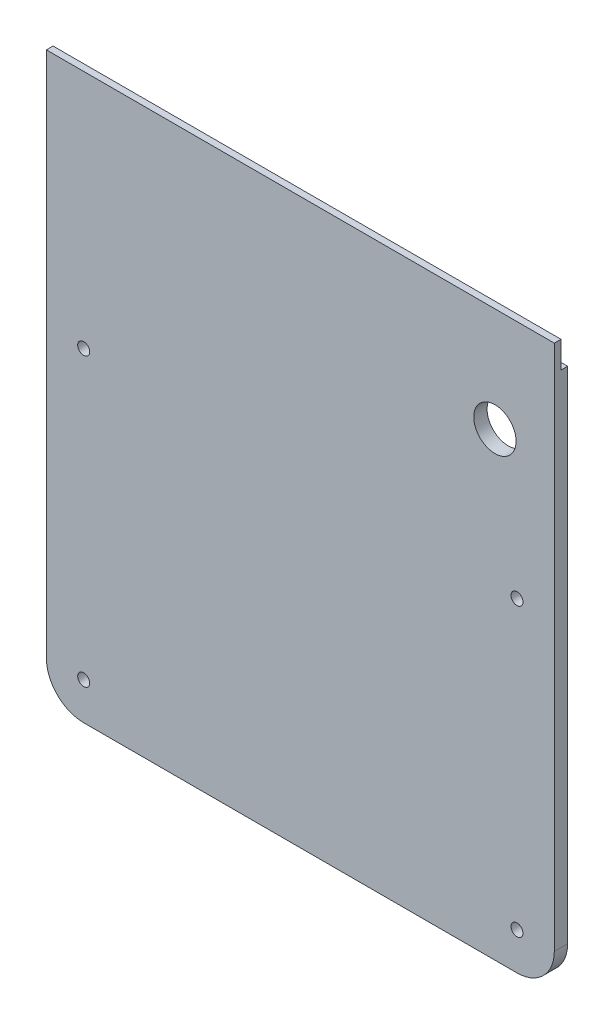
ISO-10303-21;
HEADER;
FILE_DESCRIPTION(('STEP AP214'),'2;1');
FILE_NAME('part.step','',(''),(''),'','','');
FILE_SCHEMA(('AUTOMOTIVE_DESIGN { 1 0 10303 214 1 1 1 1 }'));
ENDSEC;
DATA;
#1=APPLICATION_CONTEXT('core data for automotive mechanical design processes');
#2=APPLICATION_PROTOCOL_DEFINITION('international standard','automotive_design',2000,#1);
#3=PRODUCT_CONTEXT('',#1,'mechanical');
#4=PRODUCT('Part','Part','',(#3));
#5=PRODUCT_RELATED_PRODUCT_CATEGORY('part','',(#4));
#6=PRODUCT_DEFINITION_FORMATION('','',#4);
#7=PRODUCT_DEFINITION_CONTEXT('part definition',#1,'design');
#8=PRODUCT_DEFINITION('design','',#6,#7);
#9=PRODUCT_DEFINITION_SHAPE('','',#8);
#10=(LENGTH_UNIT() NAMED_UNIT(*) SI_UNIT(.MILLI.,.METRE.));
#11=(NAMED_UNIT(*) PLANE_ANGLE_UNIT() SI_UNIT($,.RADIAN.));
#12=(NAMED_UNIT(*) SI_UNIT($,.STERADIAN.) SOLID_ANGLE_UNIT());
#13=UNCERTAINTY_MEASURE_WITH_UNIT(LENGTH_MEASURE(1.E-05),#10,'distance_accuracy_value','');
#14=(GEOMETRIC_REPRESENTATION_CONTEXT(3) GLOBAL_UNCERTAINTY_ASSIGNED_CONTEXT((#13)) GLOBAL_UNIT_ASSIGNED_CONTEXT((#10,
#11,#12)) REPRESENTATION_CONTEXT('',''));
#15=CARTESIAN_POINT('',(0.,0.,0.));
#16=DIRECTION('',(0.,0.,1.));
#17=DIRECTION('',(1.,0.,0.));
#18=AXIS2_PLACEMENT_3D('',#15,#16,#17);
#19=CARTESIAN_POINT('',(-80.0801129234629,0.,5.));
#20=DIRECTION('',(-1.,0.,0.));
#21=DIRECTION('',(0.,-1.,0.));
#22=AXIS2_PLACEMENT_3D('',#19,#20,#21);
#23=PLANE('',#22);
#24=DIRECTION('',(0.,0.,-1.));
#25=VECTOR('',#24,1.);
#26=CARTESIAN_POINT('',(-80.080112923463,-1000.00000000001,2.5));
#27=LINE('',#26,#25);
#28=CARTESIAN_POINT('',(-80.080112923463,-1000.00000000001,2.5));
#29=VERTEX_POINT('',#28);
#30=CARTESIAN_POINT('',(-80.080112923463,-1000.00000000001,0.));
#31=VERTEX_POINT('',#30);
#32=EDGE_CURVE('E132',#29,#31,#27,.T.);
#33=ORIENTED_EDGE('',*,*,#32,.T.);
#34=DIRECTION('',(0.,1.,0.));
#35=VECTOR('',#34,1.);
#36=CARTESIAN_POINT('',(-80.0801129234629,0.,0.));
#37=LINE('',#36,#35);
#38=CARTESIAN_POINT('',(-80.0801129234629,-1187.56262000001,0.));
#39=VERTEX_POINT('',#38);
#40=EDGE_CURVE('E165',#39,#31,#37,.T.);
#41=ORIENTED_EDGE('',*,*,#40,.F.);
#42=DIRECTION('',(0.,0.,-1.));
#43=VECTOR('',#42,1.);
#44=CARTESIAN_POINT('',(-80.0801129234629,-1187.56262000001,5.));
#45=LINE('',#44,#43);
#46=CARTESIAN_POINT('',(-80.0801129234629,-1187.56262000001,5.));
#47=VERTEX_POINT('',#46);
#48=EDGE_CURVE('E11',#47,#39,#45,.T.);
#49=ORIENTED_EDGE('',*,*,#48,.F.);
#50=DIRECTION('',(0.,1.,0.));
#51=VECTOR('',#50,1.);
#52=CARTESIAN_POINT('',(-80.0801129234629,0.,5.));
#53=LINE('',#52,#51);
#54=CARTESIAN_POINT('',(-80.080112923463,-990.000000000007,5.));
#55=VERTEX_POINT('',#54);
#56=EDGE_CURVE('E131',#47,#55,#53,.T.);
#57=ORIENTED_EDGE('',*,*,#56,.T.);
#58=DIRECTION('',(0.,0.,-1.));
#59=VECTOR('',#58,1.);
#60=CARTESIAN_POINT('',(-80.080112923463,-990.000000000007,5.));
#61=LINE('',#60,#59);
#62=CARTESIAN_POINT('',(-80.080112923463,-990.000000000007,2.5));
#63=VERTEX_POINT('',#62);
#64=EDGE_CURVE('E117',#55,#63,#61,.T.);
#65=ORIENTED_EDGE('',*,*,#64,.T.);
#66=DIRECTION('',(0.,-1.,0.));
#67=VECTOR('',#66,1.);
#68=CARTESIAN_POINT('',(-80.080112923463,-990.000000000007,2.5));
#69=LINE('',#68,#67);
#70=EDGE_CURVE('E125',#63,#29,#69,.T.);
#71=ORIENTED_EDGE('',*,*,#70,.T.);
#72=EDGE_LOOP('',(#33,#41,#49,#57,#65,#71));
#73=FACE_BOUND('',#72,.T.);
#74=ADVANCED_FACE('F45',(#73),#23,.T.);
#75=CARTESIAN_POINT('',(-66.0801129234629,-1187.56262000001,5.));
#76=DIRECTION('',(0.,0.,-1.));
#77=DIRECTION('',(-1.,0.,0.));
#78=AXIS2_PLACEMENT_3D('',#75,#76,#77);
#79=CYLINDRICAL_SURFACE('',#78,14.);
#80=CARTESIAN_POINT('',(-66.0801129234629,-1187.56262000001,0.));
#81=DIRECTION('',(0.,0.,1.));
#82=DIRECTION('',(1.,0.,0.));
#83=AXIS2_PLACEMENT_3D('',#80,#81,#82);
#84=CIRCLE('',#83,14.);
#85=CARTESIAN_POINT('',(-66.0801129234629,-1201.56262000001,0.));
#86=VERTEX_POINT('',#85);
#87=EDGE_CURVE('E168',#39,#86,#84,.T.);
#88=ORIENTED_EDGE('',*,*,#87,.T.);
#89=DIRECTION('',(0.,0.,-1.));
#90=VECTOR('',#89,1.);
#91=CARTESIAN_POINT('',(-66.0801129234629,-1201.56262000001,5.));
#92=LINE('',#91,#90);
#93=CARTESIAN_POINT('',(-66.0801129234629,-1201.56262000001,5.));
#94=VERTEX_POINT('',#93);
#95=EDGE_CURVE('E52',#94,#86,#92,.T.);
#96=ORIENTED_EDGE('',*,*,#95,.F.);
#97=CARTESIAN_POINT('',(-66.0801129234629,-1187.56262000001,5.));
#98=DIRECTION('',(0.,0.,1.));
#99=DIRECTION('',(1.,0.,0.));
#100=AXIS2_PLACEMENT_3D('',#97,#98,#99);
#101=CIRCLE('',#100,14.);
#102=EDGE_CURVE('E135',#47,#94,#101,.T.);
#103=ORIENTED_EDGE('',*,*,#102,.F.);
#104=ORIENTED_EDGE('',*,*,#48,.T.);
#105=EDGE_LOOP('',(#88,#96,#103,#104));
#106=FACE_BOUND('',#105,.T.);
#107=ADVANCED_FACE('F206',(#106),#79,.T.);
#108=CARTESIAN_POINT('',(-1.64184921384977E-12,-1201.56262000001,5.));
#109=DIRECTION('',(0.,1.,0.));
#110=DIRECTION('',(-1.,0.,0.));
#111=AXIS2_PLACEMENT_3D('',#108,#109,#110);
#112=PLANE('',#111);
#113=DIRECTION('',(1.,0.,0.));
#114=VECTOR('',#113,1.);
#115=CARTESIAN_POINT('',(-1.64184921384977E-12,-1201.56262000001,0.));
#116=LINE('',#115,#114);
#117=CARTESIAN_POINT('',(96.4198870765371,-1201.56262000001,0.));
#118=VERTEX_POINT('',#117);
#119=EDGE_CURVE('E171',#86,#118,#116,.T.);
#120=ORIENTED_EDGE('',*,*,#119,.T.);
#121=DIRECTION('',(0.,0.,-1.));
#122=VECTOR('',#121,1.);
#123=CARTESIAN_POINT('',(96.4198870765371,-1201.56262000001,5.));
#124=LINE('',#123,#122);
#125=CARTESIAN_POINT('',(96.4198870765371,-1201.56262000001,5.));
#126=VERTEX_POINT('',#125);
#127=EDGE_CURVE('E189',#126,#118,#124,.T.);
#128=ORIENTED_EDGE('',*,*,#127,.F.);
#129=DIRECTION('',(1.,0.,0.));
#130=VECTOR('',#129,1.);
#131=CARTESIAN_POINT('',(-1.64184921384977E-12,-1201.56262000001,5.));
#132=LINE('',#131,#130);
#133=EDGE_CURVE('E138',#94,#126,#132,.T.);
#134=ORIENTED_EDGE('',*,*,#133,.F.);
#135=ORIENTED_EDGE('',*,*,#95,.T.);
#136=EDGE_LOOP('',(#120,#128,#134,#135));
#137=FACE_BOUND('',#136,.T.);
#138=ADVANCED_FACE('F196',(#137),#112,.F.);
#139=CARTESIAN_POINT('',(96.4198870765371,-1187.56262000001,5.));
#140=DIRECTION('',(0.,0.,-1.));
#141=DIRECTION('',(-1.,0.,0.));
#142=AXIS2_PLACEMENT_3D('',#139,#140,#141);
#143=CYLINDRICAL_SURFACE('',#142,14.0000000000003);
#144=CARTESIAN_POINT('',(96.4198870765371,-1187.56262000001,0.));
#145=DIRECTION('',(0.,0.,1.));
#146=DIRECTION('',(1.,0.,0.));
#147=AXIS2_PLACEMENT_3D('',#144,#145,#146);
#148=CIRCLE('',#147,14.0000000000003);
#149=CARTESIAN_POINT('',(110.419887076537,-1187.56262000001,0.));
#150=VERTEX_POINT('',#149);
#151=EDGE_CURVE('E173',#118,#150,#148,.T.);
#152=ORIENTED_EDGE('',*,*,#151,.T.);
#153=DIRECTION('',(0.,0.,-1.));
#154=VECTOR('',#153,1.);
#155=CARTESIAN_POINT('',(110.419887076537,-1187.56262000001,5.));
#156=LINE('',#155,#154);
#157=CARTESIAN_POINT('',(110.419887076537,-1187.56262000001,5.));
#158=VERTEX_POINT('',#157);
#159=EDGE_CURVE('E164',#158,#150,#156,.T.);
#160=ORIENTED_EDGE('',*,*,#159,.F.);
#161=CARTESIAN_POINT('',(96.4198870765371,-1187.56262000001,5.));
#162=DIRECTION('',(0.,0.,1.));
#163=DIRECTION('',(1.,0.,0.));
#164=AXIS2_PLACEMENT_3D('',#161,#162,#163);
#165=CIRCLE('',#164,14.0000000000003);
#166=EDGE_CURVE('E146',#126,#158,#165,.T.);
#167=ORIENTED_EDGE('',*,*,#166,.F.);
#168=ORIENTED_EDGE('',*,*,#127,.T.);
#169=EDGE_LOOP('',(#152,#160,#167,#168));
#170=FACE_BOUND('',#169,.T.);
#171=ADVANCED_FACE('F204',(#170),#143,.T.);
#172=CARTESIAN_POINT('',(110.419887076537,0.,5.));
#173=DIRECTION('',(1.,0.,0.));
#174=DIRECTION('',(0.,0.,-1.));
#175=AXIS2_PLACEMENT_3D('',#172,#173,#174);
#176=PLANE('',#175);
#177=DIRECTION('',(0.,0.,-1.));
#178=VECTOR('',#177,1.);
#179=CARTESIAN_POINT('',(110.419887076537,-1000.00000000001,2.5));
#180=LINE('',#179,#178);
#181=CARTESIAN_POINT('',(110.419887076537,-1000.00000000001,2.5));
#182=VERTEX_POINT('',#181);
#183=CARTESIAN_POINT('',(110.419887076537,-1000.00000000001,0.));
#184=VERTEX_POINT('',#183);
#185=EDGE_CURVE('E59',#182,#184,#180,.T.);
#186=ORIENTED_EDGE('',*,*,#185,.F.);
#187=DIRECTION('',(0.,-1.,0.));
#188=VECTOR('',#187,1.);
#189=CARTESIAN_POINT('',(110.419887076537,-990.000000000007,2.5));
#190=LINE('',#189,#188);
#191=CARTESIAN_POINT('',(110.419887076537,-990.000000000007,2.5));
#192=VERTEX_POINT('',#191);
#193=EDGE_CURVE('E437',#192,#182,#190,.T.);
#194=ORIENTED_EDGE('',*,*,#193,.F.);
#195=DIRECTION('',(0.,0.,-1.));
#196=VECTOR('',#195,1.);
#197=CARTESIAN_POINT('',(110.419887076537,-990.000000000007,5.));
#198=LINE('',#197,#196);
#199=CARTESIAN_POINT('',(110.419887076537,-990.000000000007,5.));
#200=VERTEX_POINT('',#199);
#201=EDGE_CURVE('E440',#200,#192,#198,.T.);
#202=ORIENTED_EDGE('',*,*,#201,.F.);
#203=DIRECTION('',(0.,-1.,0.));
#204=VECTOR('',#203,1.);
#205=CARTESIAN_POINT('',(110.419887076537,0.,5.));
#206=LINE('',#205,#204);
#207=EDGE_CURVE('E68',#200,#158,#206,.T.);
#208=ORIENTED_EDGE('',*,*,#207,.T.);
#209=ORIENTED_EDGE('',*,*,#159,.T.);
#210=DIRECTION('',(0.,-1.,0.));
#211=VECTOR('',#210,1.);
#212=CARTESIAN_POINT('',(110.419887076537,0.,0.));
#213=LINE('',#212,#211);
#214=EDGE_CURVE('E89',#184,#150,#213,.T.);
#215=ORIENTED_EDGE('',*,*,#214,.F.);
#216=EDGE_LOOP('',(#186,#194,#202,#208,#209,#215));
#217=FACE_BOUND('',#216,.T.);
#218=ADVANCED_FACE('F216',(#217),#176,.T.);
#219=CARTESIAN_POINT('',(-66.080112923463,-1080.00000000001,5.));
#220=DIRECTION('',(0.,0.,-1.));
#221=DIRECTION('',(-1.,0.,0.));
#222=AXIS2_PLACEMENT_3D('',#219,#220,#221);
#223=CYLINDRICAL_SURFACE('',#222,2.25000000000011);
#224=CARTESIAN_POINT('',(-66.080112923463,-1080.00000000001,5.));
#225=DIRECTION('',(0.,0.,1.));
#226=DIRECTION('',(1.,0.,0.));
#227=AXIS2_PLACEMENT_3D('',#224,#225,#226);
#228=CIRCLE('',#227,2.25000000000011);
#229=CARTESIAN_POINT('',(-63.8301129234629,-1080.00000000001,5.));
#230=VERTEX_POINT('',#229);
#231=EDGE_CURVE('E161',#230,#230,#228,.T.);
#232=ORIENTED_EDGE('',*,*,#231,.T.);
#233=EDGE_LOOP('',(#232));
#234=FACE_BOUND('',#233,.T.);
#235=CARTESIAN_POINT('',(-66.080112923463,-1080.00000000001,0.));
#236=DIRECTION('',(0.,0.,1.));
#237=DIRECTION('',(1.,0.,0.));
#238=AXIS2_PLACEMENT_3D('',#235,#236,#237);
#239=CIRCLE('',#238,2.25000000000011);
#240=CARTESIAN_POINT('',(-63.8301129234629,-1080.00000000001,0.));
#241=VERTEX_POINT('',#240);
#242=EDGE_CURVE('E136',#241,#241,#239,.T.);
#243=ORIENTED_EDGE('',*,*,#242,.F.);
#244=EDGE_LOOP('',(#243));
#245=FACE_BOUND('',#244,.T.);
#246=ADVANCED_FACE('F219',(#234,#245),#223,.F.);
#247=CARTESIAN_POINT('',(-66.0801129234629,-1187.56262000001,5.));
#248=DIRECTION('',(0.,0.,-1.));
#249=DIRECTION('',(-1.,0.,0.));
#250=AXIS2_PLACEMENT_3D('',#247,#248,#249);
#251=CYLINDRICAL_SURFACE('',#250,2.25000000000009);
#252=CARTESIAN_POINT('',(-66.0801129234629,-1187.56262000001,5.));
#253=DIRECTION('',(0.,0.,1.));
#254=DIRECTION('',(1.,0.,0.));
#255=AXIS2_PLACEMENT_3D('',#252,#253,#254);
#256=CIRCLE('',#255,2.25000000000009);
#257=CARTESIAN_POINT('',(-63.8301129234629,-1187.56262000001,5.));
#258=VERTEX_POINT('',#257);
#259=EDGE_CURVE('E158',#258,#258,#256,.T.);
#260=ORIENTED_EDGE('',*,*,#259,.T.);
#261=EDGE_LOOP('',(#260));
#262=FACE_BOUND('',#261,.T.);
#263=CARTESIAN_POINT('',(-66.0801129234629,-1187.56262000001,0.));
#264=DIRECTION('',(0.,0.,1.));
#265=DIRECTION('',(1.,0.,0.));
#266=AXIS2_PLACEMENT_3D('',#263,#264,#265);
#267=CIRCLE('',#266,2.25000000000009);
#268=CARTESIAN_POINT('',(-63.8301129234629,-1187.56262000001,0.));
#269=VERTEX_POINT('',#268);
#270=EDGE_CURVE('E141',#269,#269,#267,.T.);
#271=ORIENTED_EDGE('',*,*,#270,.F.);
#272=EDGE_LOOP('',(#271));
#273=FACE_BOUND('',#272,.T.);
#274=ADVANCED_FACE('F231',(#262,#273),#251,.F.);
#275=CARTESIAN_POINT('',(96.4198870765371,-1187.56262000001,5.));
#276=DIRECTION('',(0.,0.,-1.));
#277=DIRECTION('',(-1.,0.,0.));
#278=AXIS2_PLACEMENT_3D('',#275,#276,#277);
#279=CYLINDRICAL_SURFACE('',#278,2.25000000000011);
#280=CARTESIAN_POINT('',(96.4198870765371,-1187.56262000001,5.));
#281=DIRECTION('',(0.,0.,1.));
#282=DIRECTION('',(1.,0.,0.));
#283=AXIS2_PLACEMENT_3D('',#280,#281,#282);
#284=CIRCLE('',#283,2.25000000000011);
#285=CARTESIAN_POINT('',(98.6698870765372,-1187.56262000001,5.));
#286=VERTEX_POINT('',#285);
#287=EDGE_CURVE('E155',#286,#286,#284,.T.);
#288=ORIENTED_EDGE('',*,*,#287,.T.);
#289=EDGE_LOOP('',(#288));
#290=FACE_BOUND('',#289,.T.);
#291=CARTESIAN_POINT('',(96.4198870765371,-1187.56262000001,0.));
#292=DIRECTION('',(0.,0.,1.));
#293=DIRECTION('',(1.,0.,0.));
#294=AXIS2_PLACEMENT_3D('',#291,#292,#293);
#295=CIRCLE('',#294,2.25000000000011);
#296=CARTESIAN_POINT('',(98.6698870765372,-1187.56262000001,0.));
#297=VERTEX_POINT('',#296);
#298=EDGE_CURVE('E183',#297,#297,#295,.T.);
#299=ORIENTED_EDGE('',*,*,#298,.F.);
#300=EDGE_LOOP('',(#299));
#301=FACE_BOUND('',#300,.T.);
#302=ADVANCED_FACE('F227',(#290,#301),#279,.F.);
#303=CARTESIAN_POINT('',(96.4198870765371,-1080.00000000001,5.));
#304=DIRECTION('',(0.,0.,-1.));
#305=DIRECTION('',(-1.,0.,0.));
#306=AXIS2_PLACEMENT_3D('',#303,#304,#305);
#307=CYLINDRICAL_SURFACE('',#306,2.25000000000009);
#308=CARTESIAN_POINT('',(96.4198870765371,-1080.00000000001,5.));
#309=DIRECTION('',(0.,0.,1.));
#310=DIRECTION('',(1.,0.,0.));
#311=AXIS2_PLACEMENT_3D('',#308,#309,#310);
#312=CIRCLE('',#311,2.25000000000009);
#313=CARTESIAN_POINT('',(98.6698870765372,-1080.00000000001,5.));
#314=VERTEX_POINT('',#313);
#315=EDGE_CURVE('E152',#314,#314,#312,.T.);
#316=ORIENTED_EDGE('',*,*,#315,.T.);
#317=EDGE_LOOP('',(#316));
#318=FACE_BOUND('',#317,.T.);
#319=CARTESIAN_POINT('',(96.4198870765371,-1080.00000000001,0.));
#320=DIRECTION('',(0.,0.,1.));
#321=DIRECTION('',(1.,0.,0.));
#322=AXIS2_PLACEMENT_3D('',#319,#320,#321);
#323=CIRCLE('',#322,2.25000000000009);
#324=CARTESIAN_POINT('',(98.6698870765372,-1080.00000000001,0.));
#325=VERTEX_POINT('',#324);
#326=EDGE_CURVE('E180',#325,#325,#323,.T.);
#327=ORIENTED_EDGE('',*,*,#326,.F.);
#328=EDGE_LOOP('',(#327));
#329=FACE_BOUND('',#328,.T.);
#330=ADVANCED_FACE('F223',(#318,#329),#307,.F.);
#331=CARTESIAN_POINT('',(88.1478081868197,-1029.07998350006,5.));
#332=DIRECTION('',(0.,0.,-1.));
#333=DIRECTION('',(-1.,0.,0.));
#334=AXIS2_PLACEMENT_3D('',#331,#332,#333);
#335=CYLINDRICAL_SURFACE('',#334,7.93749999999994);
#336=CARTESIAN_POINT('',(88.1478081868197,-1029.07998350006,5.));
#337=DIRECTION('',(0.,0.,1.));
#338=DIRECTION('',(1.,0.,0.));
#339=AXIS2_PLACEMENT_3D('',#336,#337,#338);
#340=CIRCLE('',#339,7.93749999999994);
#341=CARTESIAN_POINT('',(96.0853081868196,-1029.07998350006,5.));
#342=VERTEX_POINT('',#341);
#343=EDGE_CURVE('E149',#342,#342,#340,.T.);
#344=ORIENTED_EDGE('',*,*,#343,.T.);
#345=EDGE_LOOP('',(#344));
#346=FACE_BOUND('',#345,.T.);
#347=CARTESIAN_POINT('',(88.1478081868197,-1029.07998350006,0.));
#348=DIRECTION('',(0.,0.,1.));
#349=DIRECTION('',(1.,0.,0.));
#350=AXIS2_PLACEMENT_3D('',#347,#348,#349);
#351=CIRCLE('',#350,7.93749999999994);
#352=CARTESIAN_POINT('',(96.0853081868196,-1029.07998350006,0.));
#353=VERTEX_POINT('',#352);
#354=EDGE_CURVE('E177',#353,#353,#351,.T.);
#355=ORIENTED_EDGE('',*,*,#354,.F.);
#356=EDGE_LOOP('',(#355));
#357=FACE_BOUND('',#356,.T.);
#358=ADVANCED_FACE('F220',(#346,#357),#335,.F.);
#359=CARTESIAN_POINT('',(0.,0.,5.));
#360=DIRECTION('',(0.,0.,1.));
#361=DIRECTION('',(1.,0.,0.));
#362=AXIS2_PLACEMENT_3D('',#359,#360,#361);
#363=PLANE('',#362);
#364=DIRECTION('',(1.,0.,0.));
#365=VECTOR('',#364,1.);
#366=CARTESIAN_POINT('',(-80.080112923463,-990.000000000007,5.));
#367=LINE('',#366,#365);
#368=EDGE_CURVE('E121',#55,#200,#367,.T.);
#369=ORIENTED_EDGE('',*,*,#368,.F.);
#370=ORIENTED_EDGE('',*,*,#56,.F.);
#371=ORIENTED_EDGE('',*,*,#102,.T.);
#372=ORIENTED_EDGE('',*,*,#133,.T.);
#373=ORIENTED_EDGE('',*,*,#166,.T.);
#374=ORIENTED_EDGE('',*,*,#207,.F.);
#375=EDGE_LOOP('',(#369,#370,#371,#372,#373,#374));
#376=FACE_BOUND('',#375,.T.);
#377=ORIENTED_EDGE('',*,*,#343,.F.);
#378=EDGE_LOOP('',(#377));
#379=FACE_BOUND('',#378,.T.);
#380=ORIENTED_EDGE('',*,*,#315,.F.);
#381=EDGE_LOOP('',(#380));
#382=FACE_BOUND('',#381,.T.);
#383=ORIENTED_EDGE('',*,*,#287,.F.);
#384=EDGE_LOOP('',(#383));
#385=FACE_BOUND('',#384,.T.);
#386=ORIENTED_EDGE('',*,*,#259,.F.);
#387=EDGE_LOOP('',(#386));
#388=FACE_BOUND('',#387,.T.);
#389=ORIENTED_EDGE('',*,*,#231,.F.);
#390=EDGE_LOOP('',(#389));
#391=FACE_BOUND('',#390,.T.);
#392=ADVANCED_FACE('F129',(#376,#379,#382,#385,#388,#391),#363,.T.);
#393=CARTESIAN_POINT('',(0.,0.,0.));
#394=DIRECTION('',(0.,0.,1.));
#395=DIRECTION('',(1.,0.,0.));
#396=AXIS2_PLACEMENT_3D('',#393,#394,#395);
#397=PLANE('',#396);
#398=ORIENTED_EDGE('',*,*,#40,.T.);
#399=DIRECTION('',(1.,0.,0.));
#400=VECTOR('',#399,1.);
#401=CARTESIAN_POINT('',(-80.080112923463,-1000.00000000001,0.));
#402=LINE('',#401,#400);
#403=EDGE_CURVE('E169',#31,#184,#402,.T.);
#404=ORIENTED_EDGE('',*,*,#403,.T.);
#405=ORIENTED_EDGE('',*,*,#214,.T.);
#406=ORIENTED_EDGE('',*,*,#151,.F.);
#407=ORIENTED_EDGE('',*,*,#119,.F.);
#408=ORIENTED_EDGE('',*,*,#87,.F.);
#409=EDGE_LOOP('',(#398,#404,#405,#406,#407,#408));
#410=FACE_BOUND('',#409,.T.);
#411=ORIENTED_EDGE('',*,*,#354,.T.);
#412=EDGE_LOOP('',(#411));
#413=FACE_BOUND('',#412,.T.);
#414=ORIENTED_EDGE('',*,*,#326,.T.);
#415=EDGE_LOOP('',(#414));
#416=FACE_BOUND('',#415,.T.);
#417=ORIENTED_EDGE('',*,*,#298,.T.);
#418=EDGE_LOOP('',(#417));
#419=FACE_BOUND('',#418,.T.);
#420=ORIENTED_EDGE('',*,*,#270,.T.);
#421=EDGE_LOOP('',(#420));
#422=FACE_BOUND('',#421,.T.);
#423=ORIENTED_EDGE('',*,*,#242,.T.);
#424=EDGE_LOOP('',(#423));
#425=FACE_BOUND('',#424,.T.);
#426=ADVANCED_FACE('F200',(#410,#413,#416,#419,#422,#425),#397,.F.);
#427=CARTESIAN_POINT('',(-80.080112923463,-1000.00000000001,2.5));
#428=DIRECTION('',(0.,-1.,0.));
#429=DIRECTION('',(0.,0.,-1.));
#430=AXIS2_PLACEMENT_3D('',#427,#428,#429);
#431=PLANE('',#430);
#432=ORIENTED_EDGE('',*,*,#185,.T.);
#433=ORIENTED_EDGE('',*,*,#403,.F.);
#434=ORIENTED_EDGE('',*,*,#32,.F.);
#435=DIRECTION('',(1.,0.,0.));
#436=VECTOR('',#435,1.);
#437=CARTESIAN_POINT('',(-80.080112923463,-1000.00000000001,2.5));
#438=LINE('',#437,#436);
#439=EDGE_CURVE('E438',#29,#182,#438,.T.);
#440=ORIENTED_EDGE('',*,*,#439,.T.);
#441=EDGE_LOOP('',(#432,#433,#434,#440));
#442=FACE_BOUND('',#441,.T.);
#443=ADVANCED_FACE('F241',(#442),#431,.F.);
#444=CARTESIAN_POINT('',(-80.080112923463,-990.000000000007,2.5));
#445=DIRECTION('',(0.,0.,1.));
#446=DIRECTION('',(0.,-1.,0.));
#447=AXIS2_PLACEMENT_3D('',#444,#445,#446);
#448=PLANE('',#447);
#449=ORIENTED_EDGE('',*,*,#193,.T.);
#450=ORIENTED_EDGE('',*,*,#439,.F.);
#451=ORIENTED_EDGE('',*,*,#70,.F.);
#452=DIRECTION('',(1.,0.,0.));
#453=VECTOR('',#452,1.);
#454=CARTESIAN_POINT('',(-80.080112923463,-990.000000000007,2.5));
#455=LINE('',#454,#453);
#456=EDGE_CURVE('E122',#63,#192,#455,.T.);
#457=ORIENTED_EDGE('',*,*,#456,.T.);
#458=EDGE_LOOP('',(#449,#450,#451,#457));
#459=FACE_BOUND('',#458,.T.);
#460=ADVANCED_FACE('F246',(#459),#448,.F.);
#461=CARTESIAN_POINT('',(-80.080112923463,-990.000000000007,5.));
#462=DIRECTION('',(0.,-1.,0.));
#463=DIRECTION('',(0.,0.,-1.));
#464=AXIS2_PLACEMENT_3D('',#461,#462,#463);
#465=PLANE('',#464);
#466=ORIENTED_EDGE('',*,*,#201,.T.);
#467=ORIENTED_EDGE('',*,*,#456,.F.);
#468=ORIENTED_EDGE('',*,*,#64,.F.);
#469=ORIENTED_EDGE('',*,*,#368,.T.);
#470=EDGE_LOOP('',(#466,#467,#468,#469));
#471=FACE_BOUND('',#470,.T.);
#472=ADVANCED_FACE('F120',(#471),#465,.F.);
#473=CLOSED_SHELL('',(#74,#107,#138,#171,#218,#246,#274,#302,#330,#358,#392,#426,#443,#460,#472));
#474=MANIFOLD_SOLID_BREP('B2',#473);
#475=ADVANCED_BREP_SHAPE_REPRESENTATION('',(#18,#474),#14);
#476=SHAPE_DEFINITION_REPRESENTATION(#9,#475);
ENDSEC;
END-ISO-10303-21;
